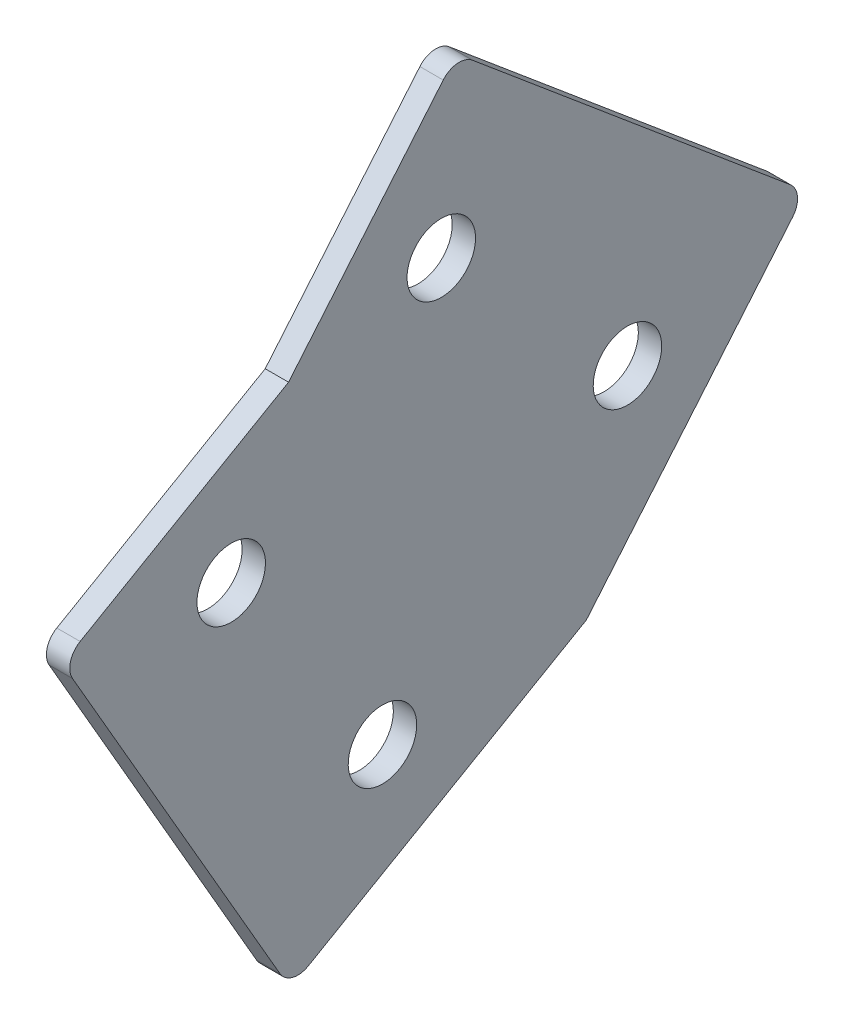
ISO-10303-21;
HEADER;
FILE_DESCRIPTION(('STEP AP214'),'2;1');
FILE_NAME('part.step','',(''),(''),'','','');
FILE_SCHEMA(('AUTOMOTIVE_DESIGN { 1 0 10303 214 1 1 1 1 }'));
ENDSEC;
DATA;
#1=APPLICATION_CONTEXT('core data for automotive mechanical design processes');
#2=APPLICATION_PROTOCOL_DEFINITION('international standard','automotive_design',2000,#1);
#3=PRODUCT_CONTEXT('',#1,'mechanical');
#4=PRODUCT('Part','Part','',(#3));
#5=PRODUCT_RELATED_PRODUCT_CATEGORY('part','',(#4));
#6=PRODUCT_DEFINITION_FORMATION('','',#4);
#7=PRODUCT_DEFINITION_CONTEXT('part definition',#1,'design');
#8=PRODUCT_DEFINITION('design','',#6,#7);
#9=PRODUCT_DEFINITION_SHAPE('','',#8);
#10=(LENGTH_UNIT() NAMED_UNIT(*) SI_UNIT(.MILLI.,.METRE.));
#11=(NAMED_UNIT(*) PLANE_ANGLE_UNIT() SI_UNIT($,.RADIAN.));
#12=(NAMED_UNIT(*) SI_UNIT($,.STERADIAN.) SOLID_ANGLE_UNIT());
#13=UNCERTAINTY_MEASURE_WITH_UNIT(LENGTH_MEASURE(1.E-05),#10,'distance_accuracy_value','');
#14=(GEOMETRIC_REPRESENTATION_CONTEXT(3) GLOBAL_UNCERTAINTY_ASSIGNED_CONTEXT((#13)) GLOBAL_UNIT_ASSIGNED_CONTEXT((#10,
#11,#12)) REPRESENTATION_CONTEXT('',''));
#15=CARTESIAN_POINT('',(0.,0.,0.));
#16=DIRECTION('',(0.,0.,1.));
#17=DIRECTION('',(1.,0.,0.));
#18=AXIS2_PLACEMENT_3D('',#15,#16,#17);
#19=CARTESIAN_POINT('',(4.191,0.,0.));
#20=DIRECTION('',(1.,0.,0.));
#21=DIRECTION('',(0.,1.,0.));
#22=AXIS2_PLACEMENT_3D('',#19,#20,#21);
#23=PLANE('',#22);
#24=DIRECTION('',(0.,-0.5,0.866025403784439));
#25=VECTOR('',#24,1.);
#26=CARTESIAN_POINT('',(4.191,50.5938833257905,29.2103921574937));
#27=LINE('',#26,#25);
#28=CARTESIAN_POINT('',(4.191,488.076839592246,-728.53231554144));
#29=VERTEX_POINT('',#28);
#30=CARTESIAN_POINT('',(4.191,499.857213586035,-748.936521830846));
#31=VERTEX_POINT('',#30);
#32=EDGE_CURVE('E130',#29,#31,#27,.F.);
#33=ORIENTED_EDGE('',*,*,#32,.F.);
#34=CARTESIAN_POINT('',(4.191,486.317075971756,-729.54831554144));
#35=DIRECTION('',(1.,0.,0.));
#36=DIRECTION('',(0.,1.,0.));
#37=AXIS2_PLACEMENT_3D('',#34,#35,#36);
#38=CIRCLE('',#37,2.03199999999998);
#39=CARTESIAN_POINT('',(4.191,485.301075971756,-727.78855192095));
#40=VERTEX_POINT('',#39);
#41=EDGE_CURVE('E169',#40,#29,#38,.F.);
#42=ORIENTED_EDGE('',*,*,#41,.F.);
#43=DIRECTION('',(0.,0.866025403784439,0.499999999999999));
#44=VECTOR('',#43,1.);
#45=CARTESIAN_POINT('',(4.191,436.466956266455,-755.982944078444));
#46=LINE('',#45,#44);
#47=CARTESIAN_POINT('',(4.191,450.137087621177,-748.090490060938));
#48=VERTEX_POINT('',#47);
#49=EDGE_CURVE('E127',#40,#48,#46,.F.);
#50=ORIENTED_EDGE('',*,*,#49,.T.);
#51=CARTESIAN_POINT('',(4.191,451.153087621177,-749.850253681428));
#52=DIRECTION('',(-1.,0.,0.));
#53=DIRECTION('',(0.,-1.,0.));
#54=AXIS2_PLACEMENT_3D('',#51,#52,#53);
#55=CIRCLE('',#54,2.03199999999998);
#56=CARTESIAN_POINT('',(4.191,449.393324000687,-750.866253681428));
#57=VERTEX_POINT('',#56);
#58=EDGE_CURVE('E87',#57,#48,#55,.T.);
#59=ORIENTED_EDGE('',*,*,#58,.F.);
#60=DIRECTION('',(0.,-0.500000000000007,0.866025403784434));
#61=VECTOR('',#60,1.);
#62=CARTESIAN_POINT('',(4.191,11.9103677342253,6.87645401750256));
#63=LINE('',#62,#61);
#64=CARTESIAN_POINT('',(4.191,465.111773874019,-778.091407478266));
#65=VERTEX_POINT('',#64);
#66=EDGE_CURVE('E108',#57,#65,#63,.F.);
#67=ORIENTED_EDGE('',*,*,#66,.T.);
#68=DIRECTION('',(0.,-0.76604444311898,0.642787609686537));
#69=VECTOR('',#68,1.);
#70=CARTESIAN_POINT('',(4.191,-190.962244353712,-227.579940758391));
#71=LINE('',#70,#69);
#72=CARTESIAN_POINT('',(4.191,489.193836233867,-798.298657122409));
#73=VERTEX_POINT('',#72);
#74=EDGE_CURVE('E96',#65,#73,#71,.F.);
#75=ORIENTED_EDGE('',*,*,#74,.T.);
#76=CARTESIAN_POINT('',(4.191,490.499980656749,-796.742054813991));
#77=DIRECTION('',(1.,0.,0.));
#78=DIRECTION('',(0.,1.,0.));
#79=AXIS2_PLACEMENT_3D('',#76,#77,#78);
#80=CIRCLE('',#79,2.03199999999998);
#81=CARTESIAN_POINT('',(4.191,492.056582965167,-798.048199236874));
#82=VERTEX_POINT('',#81);
#83=EDGE_CURVE('E103',#82,#73,#80,.F.);
#84=ORIENTED_EDGE('',*,*,#83,.F.);
#85=DIRECTION('',(0.,0.642787609686539,0.766044443118979));
#86=VECTOR('',#85,1.);
#87=CARTESIAN_POINT('',(4.191,681.712682895995,-572.024860786903));
#88=LINE('',#87,#86);
#89=CARTESIAN_POINT('',(4.191,518.15625154318,-766.943825443509));
#90=VERTEX_POINT('',#89);
#91=EDGE_CURVE('E142',#90,#82,#88,.F.);
#92=ORIENTED_EDGE('',*,*,#91,.F.);
#93=CARTESIAN_POINT('',(4.191,516.599649234763,-765.637681020626));
#94=DIRECTION('',(-1.,0.,0.));
#95=DIRECTION('',(0.,-1.,0.));
#96=AXIS2_PLACEMENT_3D('',#93,#94,#95);
#97=CIRCLE('',#96,2.03200000000003);
#98=CARTESIAN_POINT('',(4.191,517.905793657646,-764.081078712208));
#99=VERTEX_POINT('',#98);
#100=EDGE_CURVE('E172',#99,#90,#97,.T.);
#101=ORIENTED_EDGE('',*,*,#100,.F.);
#102=DIRECTION('',(0.,-0.76604444311898,0.642787609686538));
#103=VECTOR('',#102,1.);
#104=CARTESIAN_POINT('',(4.191,-162.250286929933,-193.362362348189));
#105=LINE('',#104,#103);
#106=EDGE_CURVE('E137',#31,#99,#105,.F.);
#107=ORIENTED_EDGE('',*,*,#106,.F.);
#108=EDGE_LOOP('',(#33,#42,#50,#59,#67,#75,#84,#92,#101,#107));
#109=FACE_BOUND('',#108,.T.);
#110=CARTESIAN_POINT('',(4.191,485.660263688174,-743.323076188594));
#111=DIRECTION('',(1.,0.,0.));
#112=DIRECTION('',(0.,1.,0.));
#113=AXIS2_PLACEMENT_3D('',#110,#111,#112);
#114=CIRCLE('',#113,3.35280000000088);
#115=CARTESIAN_POINT('',(4.191,489.013063688175,-743.323076188594));
#116=VERTEX_POINT('',#115);
#117=EDGE_CURVE('E104',#116,#116,#114,.F.);
#118=ORIENTED_EDGE('',*,*,#117,.T.);
#119=EDGE_LOOP('',(#118));
#120=FACE_BOUND('',#119,.T.);
#121=CARTESIAN_POINT('',(4.191,464.543311838325,-758.130409456913));
#122=DIRECTION('',(1.,0.,0.));
#123=DIRECTION('',(0.,1.,0.));
#124=AXIS2_PLACEMENT_3D('',#121,#122,#123);
#125=CIRCLE('',#124,3.35280000000132);
#126=CARTESIAN_POINT('',(4.191,467.896111838327,-758.130409456913));
#127=VERTEX_POINT('',#126);
#128=EDGE_CURVE('E177',#127,#127,#125,.F.);
#129=ORIENTED_EDGE('',*,*,#128,.T.);
#130=EDGE_LOOP('',(#129));
#131=FACE_BOUND('',#130,.T.);
#132=CARTESIAN_POINT('',(4.191,502.920103897444,-763.892552765595));
#133=DIRECTION('',(1.,0.,0.));
#134=DIRECTION('',(0.,1.,0.));
#135=AXIS2_PLACEMENT_3D('',#132,#133,#134);
#136=CIRCLE('',#135,3.35279999999982);
#137=CARTESIAN_POINT('',(4.191,506.272903897444,-763.892552765595));
#138=VERTEX_POINT('',#137);
#139=EDGE_CURVE('E179',#138,#138,#136,.F.);
#140=ORIENTED_EDGE('',*,*,#139,.T.);
#141=EDGE_LOOP('',(#140));
#142=FACE_BOUND('',#141,.T.);
#143=CARTESIAN_POINT('',(4.191,484.670807086762,-782.11742422916));
#144=DIRECTION('',(1.,0.,0.));
#145=DIRECTION('',(0.,1.,0.));
#146=AXIS2_PLACEMENT_3D('',#143,#144,#145);
#147=CIRCLE('',#146,3.35280000000049);
#148=CARTESIAN_POINT('',(4.191,488.023607086762,-782.11742422916));
#149=VERTEX_POINT('',#148);
#150=EDGE_CURVE('E20',#149,#149,#147,.F.);
#151=ORIENTED_EDGE('',*,*,#150,.T.);
#152=EDGE_LOOP('',(#151));
#153=FACE_BOUND('',#152,.T.);
#154=ADVANCED_FACE('F17',(#109,#120,#131,#142,#153),#23,.T.);
#155=CARTESIAN_POINT('',(1.905,484.670807086762,-782.11742422916));
#156=DIRECTION('',(1.,0.,0.));
#157=DIRECTION('',(0.,1.,0.));
#158=AXIS2_PLACEMENT_3D('',#155,#156,#157);
#159=CYLINDRICAL_SURFACE('',#158,3.35280000000049);
#160=CARTESIAN_POINT('',(1.905,484.670807086762,-782.11742422916));
#161=DIRECTION('',(1.,0.,0.));
#162=DIRECTION('',(0.,1.,0.));
#163=AXIS2_PLACEMENT_3D('',#160,#161,#162);
#164=CIRCLE('',#163,3.35280000000049);
#165=CARTESIAN_POINT('',(1.905,488.023607086762,-782.11742422916));
#166=VERTEX_POINT('',#165);
#167=EDGE_CURVE('E114',#166,#166,#164,.F.);
#168=ORIENTED_EDGE('',*,*,#167,.T.);
#169=EDGE_LOOP('',(#168));
#170=FACE_BOUND('',#169,.T.);
#171=ORIENTED_EDGE('',*,*,#150,.F.);
#172=EDGE_LOOP('',(#171));
#173=FACE_BOUND('',#172,.T.);
#174=ADVANCED_FACE('F187',(#170,#173),#159,.F.);
#175=CARTESIAN_POINT('',(1.905,502.920103897444,-763.892552765595));
#176=DIRECTION('',(1.,0.,0.));
#177=DIRECTION('',(0.,1.,0.));
#178=AXIS2_PLACEMENT_3D('',#175,#176,#177);
#179=CYLINDRICAL_SURFACE('',#178,3.35279999999982);
#180=CARTESIAN_POINT('',(1.905,502.920103897444,-763.892552765595));
#181=DIRECTION('',(1.,0.,0.));
#182=DIRECTION('',(0.,1.,0.));
#183=AXIS2_PLACEMENT_3D('',#180,#181,#182);
#184=CIRCLE('',#183,3.35279999999982);
#185=CARTESIAN_POINT('',(1.905,506.272903897444,-763.892552765595));
#186=VERTEX_POINT('',#185);
#187=EDGE_CURVE('E117',#186,#186,#184,.F.);
#188=ORIENTED_EDGE('',*,*,#187,.T.);
#189=EDGE_LOOP('',(#188));
#190=FACE_BOUND('',#189,.T.);
#191=ORIENTED_EDGE('',*,*,#139,.F.);
#192=EDGE_LOOP('',(#191));
#193=FACE_BOUND('',#192,.T.);
#194=ADVANCED_FACE('F189',(#190,#193),#179,.F.);
#195=CARTESIAN_POINT('',(1.905,464.543311838325,-758.130409456913));
#196=DIRECTION('',(1.,0.,0.));
#197=DIRECTION('',(0.,1.,0.));
#198=AXIS2_PLACEMENT_3D('',#195,#196,#197);
#199=CYLINDRICAL_SURFACE('',#198,3.35280000000132);
#200=CARTESIAN_POINT('',(1.905,464.543311838325,-758.130409456913));
#201=DIRECTION('',(1.,0.,0.));
#202=DIRECTION('',(0.,1.,0.));
#203=AXIS2_PLACEMENT_3D('',#200,#201,#202);
#204=CIRCLE('',#203,3.35280000000132);
#205=CARTESIAN_POINT('',(1.905,467.896111838327,-758.130409456913));
#206=VERTEX_POINT('',#205);
#207=EDGE_CURVE('E163',#206,#206,#204,.F.);
#208=ORIENTED_EDGE('',*,*,#207,.T.);
#209=EDGE_LOOP('',(#208));
#210=FACE_BOUND('',#209,.T.);
#211=ORIENTED_EDGE('',*,*,#128,.F.);
#212=EDGE_LOOP('',(#211));
#213=FACE_BOUND('',#212,.T.);
#214=ADVANCED_FACE('F196',(#210,#213),#199,.F.);
#215=CARTESIAN_POINT('',(1.905,485.660263688174,-743.323076188594));
#216=DIRECTION('',(1.,0.,0.));
#217=DIRECTION('',(0.,1.,0.));
#218=AXIS2_PLACEMENT_3D('',#215,#216,#217);
#219=CYLINDRICAL_SURFACE('',#218,3.35280000000088);
#220=CARTESIAN_POINT('',(1.905,485.660263688174,-743.323076188594));
#221=DIRECTION('',(1.,0.,0.));
#222=DIRECTION('',(0.,1.,0.));
#223=AXIS2_PLACEMENT_3D('',#220,#221,#222);
#224=CIRCLE('',#223,3.35280000000088);
#225=CARTESIAN_POINT('',(1.905,489.013063688175,-743.323076188594));
#226=VERTEX_POINT('',#225);
#227=EDGE_CURVE('E160',#226,#226,#224,.F.);
#228=ORIENTED_EDGE('',*,*,#227,.T.);
#229=EDGE_LOOP('',(#228));
#230=FACE_BOUND('',#229,.T.);
#231=ORIENTED_EDGE('',*,*,#117,.F.);
#232=EDGE_LOOP('',(#231));
#233=FACE_BOUND('',#232,.T.);
#234=ADVANCED_FACE('F242',(#230,#233),#219,.F.);
#235=CARTESIAN_POINT('',(4.191,-190.962244353712,-227.579940758391));
#236=DIRECTION('',(0.,0.642787609686537,0.76604444311898));
#237=DIRECTION('',(0.,-0.76604444311898,0.642787609686537));
#238=AXIS2_PLACEMENT_3D('',#235,#236,#237);
#239=PLANE('',#238);
#240=DIRECTION('',(1.,0.,0.));
#241=VECTOR('',#240,1.);
#242=CARTESIAN_POINT('',(4.191,489.193836233867,-798.298657122409));
#243=LINE('',#242,#241);
#244=CARTESIAN_POINT('',(1.905,489.193836233866,-798.298657122409));
#245=VERTEX_POINT('',#244);
#246=EDGE_CURVE('E101',#73,#245,#243,.F.);
#247=ORIENTED_EDGE('',*,*,#246,.F.);
#248=ORIENTED_EDGE('',*,*,#74,.F.);
#249=DIRECTION('',(1.,0.,0.));
#250=VECTOR('',#249,1.);
#251=CARTESIAN_POINT('',(4.191,465.11177387402,-778.091407478265));
#252=LINE('',#251,#250);
#253=CARTESIAN_POINT('',(1.905,465.11177387402,-778.091407478265));
#254=VERTEX_POINT('',#253);
#255=EDGE_CURVE('E100',#65,#254,#252,.F.);
#256=ORIENTED_EDGE('',*,*,#255,.T.);
#257=DIRECTION('',(0.,0.766044443118839,-0.642787609686705));
#258=VECTOR('',#257,1.);
#259=CARTESIAN_POINT('',(1.905,465.11177387402,-778.091407478265));
#260=LINE('',#259,#258);
#261=EDGE_CURVE('E159',#254,#245,#260,.T.);
#262=ORIENTED_EDGE('',*,*,#261,.T.);
#263=EDGE_LOOP('',(#247,#248,#256,#262));
#264=FACE_BOUND('',#263,.T.);
#265=ADVANCED_FACE('F98',(#264),#239,.F.);
#266=CARTESIAN_POINT('',(4.191,490.499980656749,-796.742054813991));
#267=DIRECTION('',(1.,0.,0.));
#268=DIRECTION('',(0.,1.,0.));
#269=AXIS2_PLACEMENT_3D('',#266,#267,#268);
#270=CYLINDRICAL_SURFACE('',#269,2.03199999999998);
#271=CARTESIAN_POINT('',(1.905,490.499980656749,-796.742054813991));
#272=DIRECTION('',(1.,0.,0.));
#273=DIRECTION('',(0.,1.,0.));
#274=AXIS2_PLACEMENT_3D('',#271,#272,#273);
#275=CIRCLE('',#274,2.03199999999998);
#276=CARTESIAN_POINT('',(1.905,492.056582965167,-798.048199236874));
#277=VERTEX_POINT('',#276);
#278=EDGE_CURVE('E156',#245,#277,#275,.T.);
#279=ORIENTED_EDGE('',*,*,#278,.T.);
#280=DIRECTION('',(1.,0.,0.));
#281=VECTOR('',#280,1.);
#282=CARTESIAN_POINT('',(4.19100000000001,492.056582965167,-798.048199236874));
#283=LINE('',#282,#281);
#284=EDGE_CURVE('E144',#82,#277,#283,.F.);
#285=ORIENTED_EDGE('',*,*,#284,.F.);
#286=ORIENTED_EDGE('',*,*,#83,.T.);
#287=ORIENTED_EDGE('',*,*,#246,.T.);
#288=EDGE_LOOP('',(#279,#285,#286,#287));
#289=FACE_BOUND('',#288,.T.);
#290=ADVANCED_FACE('F235',(#289),#270,.T.);
#291=CARTESIAN_POINT('',(4.19100000000001,681.712682895995,-572.024860786903));
#292=DIRECTION('',(0.,0.766044443118979,-0.642787609686539));
#293=DIRECTION('',(0.,0.642787609686539,0.766044443118979));
#294=AXIS2_PLACEMENT_3D('',#291,#292,#293);
#295=PLANE('',#294);
#296=DIRECTION('',(0.,0.642787609686539,0.766044443118979));
#297=VECTOR('',#296,1.);
#298=CARTESIAN_POINT('',(1.905,492.056582965167,-798.048199236874));
#299=LINE('',#298,#297);
#300=CARTESIAN_POINT('',(1.905,518.15625154318,-766.943825443509));
#301=VERTEX_POINT('',#300);
#302=EDGE_CURVE('E155',#277,#301,#299,.T.);
#303=ORIENTED_EDGE('',*,*,#302,.T.);
#304=DIRECTION('',(-1.,0.,0.));
#305=VECTOR('',#304,1.);
#306=CARTESIAN_POINT('',(4.191,518.15625154318,-766.943825443509));
#307=LINE('',#306,#305);
#308=EDGE_CURVE('E139',#90,#301,#307,.T.);
#309=ORIENTED_EDGE('',*,*,#308,.F.);
#310=ORIENTED_EDGE('',*,*,#91,.T.);
#311=ORIENTED_EDGE('',*,*,#284,.T.);
#312=EDGE_LOOP('',(#303,#309,#310,#311));
#313=FACE_BOUND('',#312,.T.);
#314=ADVANCED_FACE('F231',(#313),#295,.T.);
#315=CARTESIAN_POINT('',(4.191,516.599649234763,-765.637681020626));
#316=DIRECTION('',(-1.,0.,0.));
#317=DIRECTION('',(0.,-1.,0.));
#318=AXIS2_PLACEMENT_3D('',#315,#316,#317);
#319=CYLINDRICAL_SURFACE('',#318,2.03200000000003);
#320=CARTESIAN_POINT('',(1.905,516.599649234763,-765.637681020626));
#321=DIRECTION('',(-1.,0.,0.));
#322=DIRECTION('',(0.,-1.,0.));
#323=AXIS2_PLACEMENT_3D('',#320,#321,#322);
#324=CIRCLE('',#323,2.03200000000003);
#325=CARTESIAN_POINT('',(1.905,517.905793657646,-764.081078712208));
#326=VERTEX_POINT('',#325);
#327=EDGE_CURVE('E151',#301,#326,#324,.F.);
#328=ORIENTED_EDGE('',*,*,#327,.T.);
#329=DIRECTION('',(1.,0.,0.));
#330=VECTOR('',#329,1.);
#331=CARTESIAN_POINT('',(4.191,517.905793657646,-764.081078712208));
#332=LINE('',#331,#330);
#333=EDGE_CURVE('E134',#99,#326,#332,.F.);
#334=ORIENTED_EDGE('',*,*,#333,.F.);
#335=ORIENTED_EDGE('',*,*,#100,.T.);
#336=ORIENTED_EDGE('',*,*,#308,.T.);
#337=EDGE_LOOP('',(#328,#334,#335,#336));
#338=FACE_BOUND('',#337,.T.);
#339=ADVANCED_FACE('F227',(#338),#319,.T.);
#340=CARTESIAN_POINT('',(4.191,-162.250286929933,-193.362362348189));
#341=DIRECTION('',(0.,0.642787609686538,0.76604444311898));
#342=DIRECTION('',(0.,-0.76604444311898,0.642787609686538));
#343=AXIS2_PLACEMENT_3D('',#340,#341,#342);
#344=PLANE('',#343);
#345=DIRECTION('',(0.,-0.766044443118977,0.642787609686541));
#346=VECTOR('',#345,1.);
#347=CARTESIAN_POINT('',(1.905,517.905793657646,-764.081078712208));
#348=LINE('',#347,#346);
#349=CARTESIAN_POINT('',(1.905,499.857213586035,-748.936521830846));
#350=VERTEX_POINT('',#349);
#351=EDGE_CURVE('E154',#326,#350,#348,.T.);
#352=ORIENTED_EDGE('',*,*,#351,.T.);
#353=DIRECTION('',(1.,0.,0.));
#354=VECTOR('',#353,1.);
#355=CARTESIAN_POINT('',(4.191,499.857213586035,-748.936521830846));
#356=LINE('',#355,#354);
#357=EDGE_CURVE('E133',#31,#350,#356,.F.);
#358=ORIENTED_EDGE('',*,*,#357,.F.);
#359=ORIENTED_EDGE('',*,*,#106,.T.);
#360=ORIENTED_EDGE('',*,*,#333,.T.);
#361=EDGE_LOOP('',(#352,#358,#359,#360));
#362=FACE_BOUND('',#361,.T.);
#363=ADVANCED_FACE('F223',(#362),#344,.T.);
#364=CARTESIAN_POINT('',(4.191,50.5938833257905,29.2103921574937));
#365=DIRECTION('',(0.,0.866025403784439,0.5));
#366=DIRECTION('',(0.,-0.5,0.866025403784439));
#367=AXIS2_PLACEMENT_3D('',#364,#365,#366);
#368=PLANE('',#367);
#369=ORIENTED_EDGE('',*,*,#32,.T.);
#370=ORIENTED_EDGE('',*,*,#357,.T.);
#371=DIRECTION('',(0.,-0.500000000000004,0.866025403784436));
#372=VECTOR('',#371,1.);
#373=CARTESIAN_POINT('',(1.905,499.857213586035,-748.936521830846));
#374=LINE('',#373,#372);
#375=CARTESIAN_POINT('',(1.905,488.076839592246,-728.53231554144));
#376=VERTEX_POINT('',#375);
#377=EDGE_CURVE('E150',#350,#376,#374,.T.);
#378=ORIENTED_EDGE('',*,*,#377,.T.);
#379=DIRECTION('',(1.,0.,0.));
#380=VECTOR('',#379,1.);
#381=CARTESIAN_POINT('',(4.191,488.076839592246,-728.53231554144));
#382=LINE('',#381,#380);
#383=EDGE_CURVE('E171',#29,#376,#382,.F.);
#384=ORIENTED_EDGE('',*,*,#383,.F.);
#385=EDGE_LOOP('',(#369,#370,#378,#384));
#386=FACE_BOUND('',#385,.T.);
#387=ADVANCED_FACE('F219',(#386),#368,.T.);
#388=CARTESIAN_POINT('',(4.191,486.317075971756,-729.54831554144));
#389=DIRECTION('',(1.,0.,0.));
#390=DIRECTION('',(0.,1.,0.));
#391=AXIS2_PLACEMENT_3D('',#388,#389,#390);
#392=CYLINDRICAL_SURFACE('',#391,2.03199999999998);
#393=CARTESIAN_POINT('',(1.905,486.317075971756,-729.54831554144));
#394=DIRECTION('',(1.,0.,0.));
#395=DIRECTION('',(0.,1.,0.));
#396=AXIS2_PLACEMENT_3D('',#393,#394,#395);
#397=CIRCLE('',#396,2.03199999999998);
#398=CARTESIAN_POINT('',(1.905,485.301075971756,-727.78855192095));
#399=VERTEX_POINT('',#398);
#400=EDGE_CURVE('E147',#376,#399,#397,.T.);
#401=ORIENTED_EDGE('',*,*,#400,.T.);
#402=DIRECTION('',(1.,0.,0.));
#403=VECTOR('',#402,1.);
#404=CARTESIAN_POINT('',(4.191,485.301075971756,-727.78855192095));
#405=LINE('',#404,#403);
#406=EDGE_CURVE('E129',#399,#40,#405,.T.);
#407=ORIENTED_EDGE('',*,*,#406,.T.);
#408=ORIENTED_EDGE('',*,*,#41,.T.);
#409=ORIENTED_EDGE('',*,*,#383,.T.);
#410=EDGE_LOOP('',(#401,#407,#408,#409));
#411=FACE_BOUND('',#410,.T.);
#412=ADVANCED_FACE('F215',(#411),#392,.T.);
#413=CARTESIAN_POINT('',(4.191,436.466956266455,-755.982944078444));
#414=DIRECTION('',(0.,0.499999999999999,-0.866025403784439));
#415=DIRECTION('',(0.,0.866025403784439,0.499999999999999));
#416=AXIS2_PLACEMENT_3D('',#413,#414,#415);
#417=PLANE('',#416);
#418=DIRECTION('',(-1.,0.,0.));
#419=VECTOR('',#418,1.);
#420=CARTESIAN_POINT('',(4.191,450.137087621177,-748.090490060938));
#421=LINE('',#420,#419);
#422=CARTESIAN_POINT('',(1.905,450.137087621177,-748.090490060938));
#423=VERTEX_POINT('',#422);
#424=EDGE_CURVE('E38',#48,#423,#421,.T.);
#425=ORIENTED_EDGE('',*,*,#424,.F.);
#426=ORIENTED_EDGE('',*,*,#49,.F.);
#427=ORIENTED_EDGE('',*,*,#406,.F.);
#428=DIRECTION('',(0.,-0.866025403784439,-0.499999999999999));
#429=VECTOR('',#428,1.);
#430=CARTESIAN_POINT('',(1.905,485.301075971756,-727.78855192095));
#431=LINE('',#430,#429);
#432=EDGE_CURVE('E146',#399,#423,#431,.T.);
#433=ORIENTED_EDGE('',*,*,#432,.T.);
#434=EDGE_LOOP('',(#425,#426,#427,#433));
#435=FACE_BOUND('',#434,.T.);
#436=ADVANCED_FACE('F212',(#435),#417,.F.);
#437=CARTESIAN_POINT('',(4.191,451.153087621177,-749.850253681428));
#438=DIRECTION('',(-1.,0.,0.));
#439=DIRECTION('',(0.,-1.,0.));
#440=AXIS2_PLACEMENT_3D('',#437,#438,#439);
#441=CYLINDRICAL_SURFACE('',#440,2.03199999999998);
#442=ORIENTED_EDGE('',*,*,#424,.T.);
#443=CARTESIAN_POINT('',(1.905,451.153087621177,-749.850253681428));
#444=DIRECTION('',(-1.,0.,0.));
#445=DIRECTION('',(0.,-1.,0.));
#446=AXIS2_PLACEMENT_3D('',#443,#444,#445);
#447=CIRCLE('',#446,2.03199999999998);
#448=CARTESIAN_POINT('',(1.905,449.393324000687,-750.866253681428));
#449=VERTEX_POINT('',#448);
#450=EDGE_CURVE('E25',#423,#449,#447,.F.);
#451=ORIENTED_EDGE('',*,*,#450,.T.);
#452=DIRECTION('',(1.,0.,0.));
#453=VECTOR('',#452,1.);
#454=CARTESIAN_POINT('',(4.191,449.393324000687,-750.866253681428));
#455=LINE('',#454,#453);
#456=EDGE_CURVE('E110',#449,#57,#455,.T.);
#457=ORIENTED_EDGE('',*,*,#456,.T.);
#458=ORIENTED_EDGE('',*,*,#58,.T.);
#459=EDGE_LOOP('',(#442,#451,#457,#458));
#460=FACE_BOUND('',#459,.T.);
#461=ADVANCED_FACE('F206',(#460),#441,.T.);
#462=CARTESIAN_POINT('',(4.191,11.9103677342253,6.87645401750256));
#463=DIRECTION('',(0.,0.866025403784434,0.500000000000007));
#464=DIRECTION('',(0.,-0.500000000000007,0.866025403784434));
#465=AXIS2_PLACEMENT_3D('',#462,#463,#464);
#466=PLANE('',#465);
#467=ORIENTED_EDGE('',*,*,#456,.F.);
#468=DIRECTION('',(0.,0.500000000000008,-0.866025403784434));
#469=VECTOR('',#468,1.);
#470=CARTESIAN_POINT('',(1.905,449.393324000687,-750.866253681428));
#471=LINE('',#470,#469);
#472=EDGE_CURVE('E11',#449,#254,#471,.T.);
#473=ORIENTED_EDGE('',*,*,#472,.T.);
#474=ORIENTED_EDGE('',*,*,#255,.F.);
#475=ORIENTED_EDGE('',*,*,#66,.F.);
#476=EDGE_LOOP('',(#467,#473,#474,#475));
#477=FACE_BOUND('',#476,.T.);
#478=ADVANCED_FACE('F107',(#477),#466,.F.);
#479=CARTESIAN_POINT('',(1.905,0.,0.));
#480=DIRECTION('',(1.,0.,0.));
#481=DIRECTION('',(0.,1.,0.));
#482=AXIS2_PLACEMENT_3D('',#479,#480,#481);
#483=PLANE('',#482);
#484=ORIENTED_EDGE('',*,*,#472,.F.);
#485=ORIENTED_EDGE('',*,*,#450,.F.);
#486=ORIENTED_EDGE('',*,*,#432,.F.);
#487=ORIENTED_EDGE('',*,*,#400,.F.);
#488=ORIENTED_EDGE('',*,*,#377,.F.);
#489=ORIENTED_EDGE('',*,*,#351,.F.);
#490=ORIENTED_EDGE('',*,*,#327,.F.);
#491=ORIENTED_EDGE('',*,*,#302,.F.);
#492=ORIENTED_EDGE('',*,*,#278,.F.);
#493=ORIENTED_EDGE('',*,*,#261,.F.);
#494=EDGE_LOOP('',(#484,#485,#486,#487,#488,#489,#490,#491,#492,#493));
#495=FACE_BOUND('',#494,.T.);
#496=ORIENTED_EDGE('',*,*,#227,.F.);
#497=EDGE_LOOP('',(#496));
#498=FACE_BOUND('',#497,.T.);
#499=ORIENTED_EDGE('',*,*,#207,.F.);
#500=EDGE_LOOP('',(#499));
#501=FACE_BOUND('',#500,.T.);
#502=ORIENTED_EDGE('',*,*,#187,.F.);
#503=EDGE_LOOP('',(#502));
#504=FACE_BOUND('',#503,.T.);
#505=ORIENTED_EDGE('',*,*,#167,.F.);
#506=EDGE_LOOP('',(#505));
#507=FACE_BOUND('',#506,.T.);
#508=ADVANCED_FACE('F199',(#495,#498,#501,#504,#507),#483,.F.);
#509=CLOSED_SHELL('',(#154,#174,#194,#214,#234,#265,#290,#314,#339,#363,#387,#412,#436,#461,
#478,#508));
#510=MANIFOLD_SOLID_BREP('B1',#509);
#511=ADVANCED_BREP_SHAPE_REPRESENTATION('',(#18,#510),#14);
#512=SHAPE_DEFINITION_REPRESENTATION(#9,#511);
ENDSEC;
END-ISO-10303-21;
